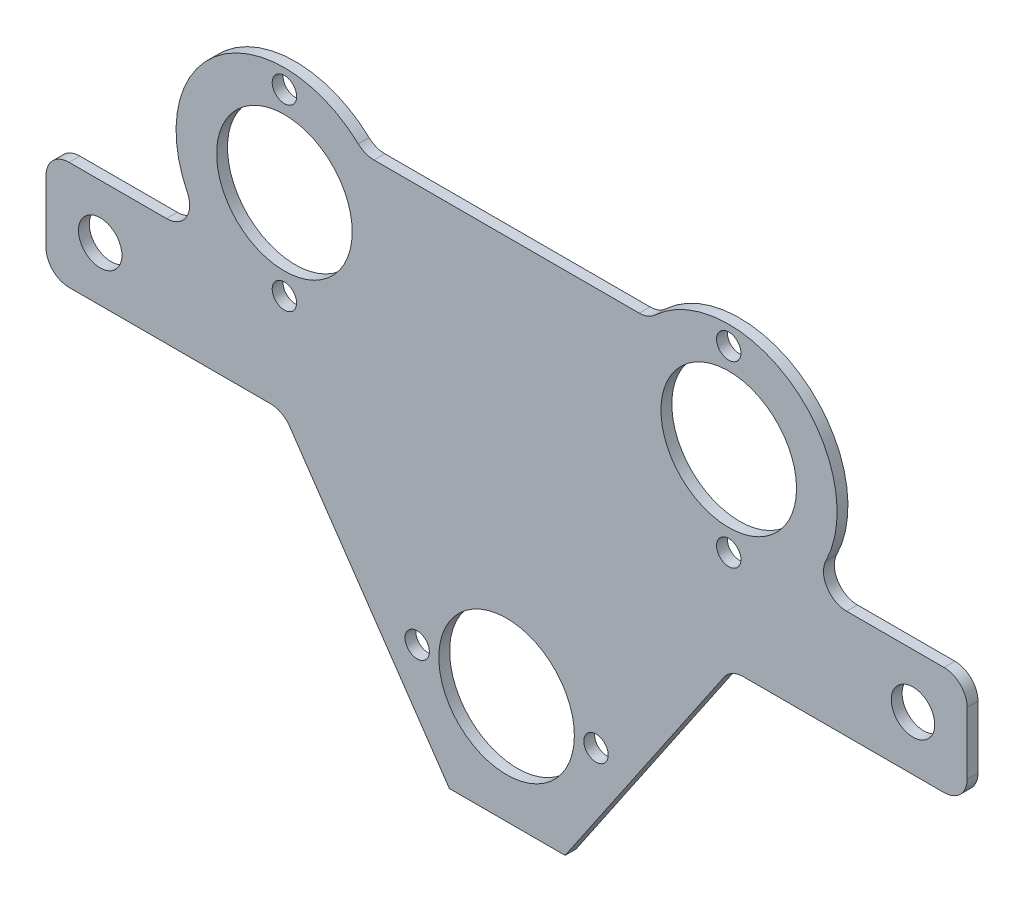
ISO-10303-21;
HEADER;
FILE_DESCRIPTION(('STEP AP214'),'2;1');
FILE_NAME('part.step','',(''),(''),'','','');
FILE_SCHEMA(('AUTOMOTIVE_DESIGN { 1 0 10303 214 1 1 1 1 }'));
ENDSEC;
DATA;
#1=APPLICATION_CONTEXT('core data for automotive mechanical design processes');
#2=APPLICATION_PROTOCOL_DEFINITION('international standard','automotive_design',2000,#1);
#3=PRODUCT_CONTEXT('',#1,'mechanical');
#4=PRODUCT('Part','Part','',(#3));
#5=PRODUCT_RELATED_PRODUCT_CATEGORY('part','',(#4));
#6=PRODUCT_DEFINITION_FORMATION('','',#4);
#7=PRODUCT_DEFINITION_CONTEXT('part definition',#1,'design');
#8=PRODUCT_DEFINITION('design','',#6,#7);
#9=PRODUCT_DEFINITION_SHAPE('','',#8);
#10=(LENGTH_UNIT() NAMED_UNIT(*) SI_UNIT(.MILLI.,.METRE.));
#11=(NAMED_UNIT(*) PLANE_ANGLE_UNIT() SI_UNIT($,.RADIAN.));
#12=(NAMED_UNIT(*) SI_UNIT($,.STERADIAN.) SOLID_ANGLE_UNIT());
#13=UNCERTAINTY_MEASURE_WITH_UNIT(LENGTH_MEASURE(1.E-05),#10,'distance_accuracy_value','');
#14=(GEOMETRIC_REPRESENTATION_CONTEXT(3) GLOBAL_UNCERTAINTY_ASSIGNED_CONTEXT((#13)) GLOBAL_UNIT_ASSIGNED_CONTEXT((#10,
#11,#12)) REPRESENTATION_CONTEXT('',''));
#15=CARTESIAN_POINT('',(0.,0.,0.));
#16=DIRECTION('',(0.,0.,1.));
#17=DIRECTION('',(1.,0.,0.));
#18=AXIS2_PLACEMENT_3D('',#15,#16,#17);
#19=CARTESIAN_POINT('',(0.,38.5,2.));
#20=DIRECTION('',(0.,1.,0.));
#21=DIRECTION('',(-1.,0.,0.));
#22=AXIS2_PLACEMENT_3D('',#19,#20,#21);
#23=PLANE('',#22);
#24=DIRECTION('',(1.,0.,0.));
#25=VECTOR('',#24,1.);
#26=CARTESIAN_POINT('',(0.,38.5,2.));
#27=LINE('',#26,#25);
#28=CARTESIAN_POINT('',(-24.4772883581417,38.5,2.));
#29=VERTEX_POINT('',#28);
#30=CARTESIAN_POINT('',(24.4772883581417,38.5,2.));
#31=VERTEX_POINT('',#30);
#32=EDGE_CURVE('E294',#29,#31,#27,.T.);
#33=ORIENTED_EDGE('',*,*,#32,.T.);
#34=DIRECTION('',(0.,0.,-1.));
#35=VECTOR('',#34,1.);
#36=CARTESIAN_POINT('',(24.4772883581417,38.5,2.));
#37=LINE('',#36,#35);
#38=CARTESIAN_POINT('',(24.4772883581417,38.5,0.));
#39=VERTEX_POINT('',#38);
#40=EDGE_CURVE('E356',#31,#39,#37,.T.);
#41=ORIENTED_EDGE('',*,*,#40,.T.);
#42=DIRECTION('',(1.,0.,0.));
#43=VECTOR('',#42,1.);
#44=CARTESIAN_POINT('',(0.,38.5,0.));
#45=LINE('',#44,#43);
#46=CARTESIAN_POINT('',(-24.4772883581417,38.5,0.));
#47=VERTEX_POINT('',#46);
#48=EDGE_CURVE('E246',#47,#39,#45,.T.);
#49=ORIENTED_EDGE('',*,*,#48,.F.);
#50=DIRECTION('',(0.,0.,-1.));
#51=VECTOR('',#50,1.);
#52=CARTESIAN_POINT('',(-24.4772883581417,38.5,2.));
#53=LINE('',#52,#51);
#54=EDGE_CURVE('E354',#47,#29,#53,.F.);
#55=ORIENTED_EDGE('',*,*,#54,.T.);
#56=EDGE_LOOP('',(#33,#41,#49,#55));
#57=FACE_BOUND('',#56,.T.);
#58=ADVANCED_FACE('F35',(#57),#23,.T.);
#59=CARTESIAN_POINT('',(-41.,25.,2.));
#60=DIRECTION('',(0.,0.,-1.));
#61=DIRECTION('',(-1.,0.,0.));
#62=AXIS2_PLACEMENT_3D('',#59,#60,#61);
#63=CYLINDRICAL_SURFACE('',#62,20.);
#64=CARTESIAN_POINT('',(-41.,25.,0.));
#65=DIRECTION('',(0.,0.,1.));
#66=DIRECTION('',(1.,0.,0.));
#67=AXIS2_PLACEMENT_3D('',#64,#65,#66);
#68=CIRCLE('',#67,20.);
#69=CARTESIAN_POINT('',(-27.3730213263024,39.639175257732,0.));
#70=VERTEX_POINT('',#69);
#71=CARTESIAN_POINT('',(-58.9274763870385,16.1340206185567,0.));
#72=VERTEX_POINT('',#71);
#73=EDGE_CURVE('E249',#70,#72,#68,.T.);
#74=ORIENTED_EDGE('',*,*,#73,.T.);
#75=DIRECTION('',(0.,0.,-1.));
#76=VECTOR('',#75,1.);
#77=CARTESIAN_POINT('',(-58.9274763870385,16.1340206185567,2.));
#78=LINE('',#77,#76);
#79=CARTESIAN_POINT('',(-58.9274763870385,16.1340206185567,2.));
#80=VERTEX_POINT('',#79);
#81=EDGE_CURVE('E348',#72,#80,#78,.F.);
#82=ORIENTED_EDGE('',*,*,#81,.T.);
#83=CARTESIAN_POINT('',(-41.,25.,2.));
#84=DIRECTION('',(0.,0.,1.));
#85=DIRECTION('',(1.,0.,0.));
#86=AXIS2_PLACEMENT_3D('',#83,#84,#85);
#87=CIRCLE('',#86,20.);
#88=CARTESIAN_POINT('',(-27.3730213263024,39.639175257732,2.));
#89=VERTEX_POINT('',#88);
#90=EDGE_CURVE('E392',#89,#80,#87,.T.);
#91=ORIENTED_EDGE('',*,*,#90,.F.);
#92=DIRECTION('',(0.,0.,-1.));
#93=VECTOR('',#92,1.);
#94=CARTESIAN_POINT('',(-27.3730213263024,39.639175257732,2.));
#95=LINE('',#94,#93);
#96=EDGE_CURVE('E345',#89,#70,#95,.T.);
#97=ORIENTED_EDGE('',*,*,#96,.T.);
#98=EDGE_LOOP('',(#74,#82,#91,#97));
#99=FACE_BOUND('',#98,.T.);
#100=ADVANCED_FACE('F395',(#99),#63,.T.);
#101=CARTESIAN_POINT('',(0.,10.,2.));
#102=DIRECTION('',(0.,1.,0.));
#103=DIRECTION('',(-1.,0.,0.));
#104=AXIS2_PLACEMENT_3D('',#101,#102,#103);
#105=PLANE('',#104);
#106=DIRECTION('',(1.,0.,0.));
#107=VECTOR('',#106,1.);
#108=CARTESIAN_POINT('',(0.,10.,0.));
#109=LINE('',#108,#107);
#110=CARTESIAN_POINT('',(-80.75,10.,0.));
#111=VERTEX_POINT('',#110);
#112=CARTESIAN_POINT('',(-62.7370651192842,10.,0.));
#113=VERTEX_POINT('',#112);
#114=EDGE_CURVE('E253',#111,#113,#109,.T.);
#115=ORIENTED_EDGE('',*,*,#114,.F.);
#116=DIRECTION('',(0.,0.,-1.));
#117=VECTOR('',#116,1.);
#118=CARTESIAN_POINT('',(-80.75,10.,2.));
#119=LINE('',#118,#117);
#120=CARTESIAN_POINT('',(-80.75,10.,2.));
#121=VERTEX_POINT('',#120);
#122=EDGE_CURVE('E324',#111,#121,#119,.F.);
#123=ORIENTED_EDGE('',*,*,#122,.T.);
#124=DIRECTION('',(1.,0.,0.));
#125=VECTOR('',#124,1.);
#126=CARTESIAN_POINT('',(0.,10.,2.));
#127=LINE('',#126,#125);
#128=CARTESIAN_POINT('',(-62.7370651192842,10.,2.));
#129=VERTEX_POINT('',#128);
#130=EDGE_CURVE('E397',#121,#129,#127,.T.);
#131=ORIENTED_EDGE('',*,*,#130,.T.);
#132=DIRECTION('',(0.,0.,-1.));
#133=VECTOR('',#132,1.);
#134=CARTESIAN_POINT('',(-62.7370651192842,10.,2.));
#135=LINE('',#134,#133);
#136=EDGE_CURVE('E321',#129,#113,#135,.T.);
#137=ORIENTED_EDGE('',*,*,#136,.T.);
#138=EDGE_LOOP('',(#115,#123,#131,#137));
#139=FACE_BOUND('',#138,.T.);
#140=ADVANCED_FACE('F437',(#139),#105,.T.);
#141=CARTESIAN_POINT('',(-85.,0.,2.));
#142=DIRECTION('',(1.,0.,0.));
#143=DIRECTION('',(0.,0.,-1.));
#144=AXIS2_PLACEMENT_3D('',#141,#142,#143);
#145=PLANE('',#144);
#146=DIRECTION('',(0.,-1.,0.));
#147=VECTOR('',#146,1.);
#148=CARTESIAN_POINT('',(-85.,0.,0.));
#149=LINE('',#148,#147);
#150=CARTESIAN_POINT('',(-85.,5.75,0.));
#151=VERTEX_POINT('',#150);
#152=CARTESIAN_POINT('',(-85.,-5.75,0.));
#153=VERTEX_POINT('',#152);
#154=EDGE_CURVE('E256',#151,#153,#149,.T.);
#155=ORIENTED_EDGE('',*,*,#154,.T.);
#156=DIRECTION('',(0.,0.,-1.));
#157=VECTOR('',#156,1.);
#158=CARTESIAN_POINT('',(-85.,-5.75,2.));
#159=LINE('',#158,#157);
#160=CARTESIAN_POINT('',(-85.,-5.75,2.));
#161=VERTEX_POINT('',#160);
#162=EDGE_CURVE('E311',#153,#161,#159,.F.);
#163=ORIENTED_EDGE('',*,*,#162,.T.);
#164=DIRECTION('',(0.,-1.,0.));
#165=VECTOR('',#164,1.);
#166=CARTESIAN_POINT('',(-85.,0.,2.));
#167=LINE('',#166,#165);
#168=CARTESIAN_POINT('',(-85.,5.75,2.));
#169=VERTEX_POINT('',#168);
#170=EDGE_CURVE('E215',#169,#161,#167,.T.);
#171=ORIENTED_EDGE('',*,*,#170,.F.);
#172=DIRECTION('',(0.,0.,-1.));
#173=VECTOR('',#172,1.);
#174=CARTESIAN_POINT('',(-85.,5.75,0.));
#175=LINE('',#174,#173);
#176=EDGE_CURVE('E308',#169,#151,#175,.T.);
#177=ORIENTED_EDGE('',*,*,#176,.T.);
#178=EDGE_LOOP('',(#155,#163,#171,#177));
#179=FACE_BOUND('',#178,.T.);
#180=ADVANCED_FACE('F467',(#179),#145,.F.);
#181=CARTESIAN_POINT('',(0.,-9.99999999999999,2.));
#182=DIRECTION('',(0.,1.,0.));
#183=DIRECTION('',(-1.,0.,0.));
#184=AXIS2_PLACEMENT_3D('',#181,#182,#183);
#185=PLANE('',#184);
#186=DIRECTION('',(1.,0.,0.));
#187=VECTOR('',#186,1.);
#188=CARTESIAN_POINT('',(0.,-9.99999999999999,2.));
#189=LINE('',#188,#187);
#190=CARTESIAN_POINT('',(-80.75,-10.,2.));
#191=VERTEX_POINT('',#190);
#192=CARTESIAN_POINT('',(-43.5501560500891,-9.99999999999999,2.));
#193=VERTEX_POINT('',#192);
#194=EDGE_CURVE('E213',#191,#193,#189,.T.);
#195=ORIENTED_EDGE('',*,*,#194,.F.);
#196=DIRECTION('',(0.,0.,-1.));
#197=VECTOR('',#196,1.);
#198=CARTESIAN_POINT('',(-80.75,-10.,2.));
#199=LINE('',#198,#197);
#200=CARTESIAN_POINT('',(-80.75,-10.,0.));
#201=VERTEX_POINT('',#200);
#202=EDGE_CURVE('E297',#191,#201,#199,.T.);
#203=ORIENTED_EDGE('',*,*,#202,.T.);
#204=DIRECTION('',(1.,0.,0.));
#205=VECTOR('',#204,1.);
#206=CARTESIAN_POINT('',(0.,-9.99999999999999,0.));
#207=LINE('',#206,#205);
#208=CARTESIAN_POINT('',(-43.5501560500891,-9.99999999999999,0.));
#209=VERTEX_POINT('',#208);
#210=EDGE_CURVE('E259',#201,#209,#207,.T.);
#211=ORIENTED_EDGE('',*,*,#210,.T.);
#212=DIRECTION('',(0.,0.,-1.));
#213=VECTOR('',#212,1.);
#214=CARTESIAN_POINT('',(-43.5501560500891,-9.99999999999999,2.));
#215=LINE('',#214,#213);
#216=EDGE_CURVE('E196',#209,#193,#215,.F.);
#217=ORIENTED_EDGE('',*,*,#216,.T.);
#218=EDGE_LOOP('',(#195,#203,#211,#217));
#219=FACE_BOUND('',#218,.T.);
#220=ADVANCED_FACE('F415',(#219),#185,.F.);
#221=CARTESIAN_POINT('',(-32.8166231841159,-22.4246925091459,2.));
#222=DIRECTION('',(-0.825644641500814,-0.564190505025556,0.));
#223=DIRECTION('',(0.564190505025556,-0.825644641500814,0.));
#224=AXIS2_PLACEMENT_3D('',#221,#222,#223);
#225=PLANE('',#224);
#226=DIRECTION('',(-0.564190505025556,0.825644641500814,0.));
#227=VECTOR('',#226,1.);
#228=CARTESIAN_POINT('',(-32.8166231841159,-22.4246925091459,2.));
#229=LINE('',#228,#227);
#230=CARTESIAN_POINT('',(-10.5568297320322,-55.,2.));
#231=VERTEX_POINT('',#230);
#232=CARTESIAN_POINT('',(-40.0411663237106,-11.8521903536414,2.));
#233=VERTEX_POINT('',#232);
#234=EDGE_CURVE('E190',#231,#233,#229,.T.);
#235=ORIENTED_EDGE('',*,*,#234,.T.);
#236=DIRECTION('',(0.,0.,-1.));
#237=VECTOR('',#236,1.);
#238=CARTESIAN_POINT('',(-40.0411663237106,-11.8521903536414,2.));
#239=LINE('',#238,#237);
#240=CARTESIAN_POINT('',(-40.0411663237106,-11.8521903536414,0.));
#241=VERTEX_POINT('',#240);
#242=EDGE_CURVE('E352',#233,#241,#239,.T.);
#243=ORIENTED_EDGE('',*,*,#242,.T.);
#244=DIRECTION('',(-0.564190505025556,0.825644641500814,0.));
#245=VECTOR('',#244,1.);
#246=CARTESIAN_POINT('',(-32.8166231841159,-22.4246925091459,0.));
#247=LINE('',#246,#245);
#248=CARTESIAN_POINT('',(-10.5568297320322,-55.,0.));
#249=VERTEX_POINT('',#248);
#250=EDGE_CURVE('E193',#249,#241,#247,.T.);
#251=ORIENTED_EDGE('',*,*,#250,.F.);
#252=DIRECTION('',(0.,0.,-1.));
#253=VECTOR('',#252,1.);
#254=CARTESIAN_POINT('',(-10.5568297320322,-55.,2.));
#255=LINE('',#254,#253);
#256=EDGE_CURVE('E185',#231,#249,#255,.T.);
#257=ORIENTED_EDGE('',*,*,#256,.F.);
#258=EDGE_LOOP('',(#235,#243,#251,#257));
#259=FACE_BOUND('',#258,.T.);
#260=ADVANCED_FACE('F187',(#259),#225,.T.);
#261=CARTESIAN_POINT('',(0.,-55.,2.));
#262=DIRECTION('',(0.,1.,0.));
#263=DIRECTION('',(0.,0.,1.));
#264=AXIS2_PLACEMENT_3D('',#261,#262,#263);
#265=PLANE('',#264);
#266=DIRECTION('',(1.,0.,0.));
#267=VECTOR('',#266,1.);
#268=CARTESIAN_POINT('',(0.,-55.,0.));
#269=LINE('',#268,#267);
#270=CARTESIAN_POINT('',(10.8054066591257,-55.,0.));
#271=VERTEX_POINT('',#270);
#272=EDGE_CURVE('E263',#249,#271,#269,.T.);
#273=ORIENTED_EDGE('',*,*,#272,.T.);
#274=DIRECTION('',(0.,0.,-1.));
#275=VECTOR('',#274,1.);
#276=CARTESIAN_POINT('',(10.8054066591257,-55.,2.));
#277=LINE('',#276,#275);
#278=CARTESIAN_POINT('',(10.8054066591257,-55.,2.));
#279=VERTEX_POINT('',#278);
#280=EDGE_CURVE('E197',#279,#271,#277,.T.);
#281=ORIENTED_EDGE('',*,*,#280,.F.);
#282=DIRECTION('',(1.,0.,0.));
#283=VECTOR('',#282,1.);
#284=CARTESIAN_POINT('',(0.,-55.,2.));
#285=LINE('',#284,#283);
#286=EDGE_CURVE('E200',#231,#279,#285,.T.);
#287=ORIENTED_EDGE('',*,*,#286,.F.);
#288=ORIENTED_EDGE('',*,*,#256,.T.);
#289=EDGE_LOOP('',(#273,#281,#287,#288));
#290=FACE_BOUND('',#289,.T.);
#291=ADVANCED_FACE('F201',(#290),#265,.F.);
#292=CARTESIAN_POINT('',(32.9610127368237,-22.4030611264261,2.));
#293=DIRECTION('',(-0.827048144621342,0.562131093676908,0.));
#294=DIRECTION('',(-0.562131093676908,-0.827048144621342,0.));
#295=AXIS2_PLACEMENT_3D('',#292,#293,#294);
#296=PLANE('',#295);
#297=DIRECTION('',(0.562131093676908,0.827048144621342,0.));
#298=VECTOR('',#297,1.);
#299=CARTESIAN_POINT('',(32.9610127368237,-22.4030611264261,0.));
#300=LINE('',#299,#298);
#301=CARTESIAN_POINT('',(40.1263180626206,-11.8609428518731,0.));
#302=VERTEX_POINT('',#301);
#303=EDGE_CURVE('E265',#271,#302,#300,.T.);
#304=ORIENTED_EDGE('',*,*,#303,.T.);
#305=DIRECTION('',(0.,0.,-1.));
#306=VECTOR('',#305,1.);
#307=CARTESIAN_POINT('',(40.1263180626206,-11.8609428518731,2.));
#308=LINE('',#307,#306);
#309=CARTESIAN_POINT('',(40.1263180626206,-11.8609428518731,2.));
#310=VERTEX_POINT('',#309);
#311=EDGE_CURVE('E350',#302,#310,#308,.F.);
#312=ORIENTED_EDGE('',*,*,#311,.T.);
#313=DIRECTION('',(0.562131093676908,0.827048144621342,0.));
#314=VECTOR('',#313,1.);
#315=CARTESIAN_POINT('',(32.9610127368237,-22.4030611264261,2.));
#316=LINE('',#315,#314);
#317=EDGE_CURVE('E205',#279,#310,#316,.T.);
#318=ORIENTED_EDGE('',*,*,#317,.F.);
#319=ORIENTED_EDGE('',*,*,#280,.T.);
#320=EDGE_LOOP('',(#304,#312,#318,#319));
#321=FACE_BOUND('',#320,.T.);
#322=ADVANCED_FACE('F480',(#321),#296,.F.);
#323=CARTESIAN_POINT('',(0.,-9.99999999999999,2.));
#324=DIRECTION('',(0.,1.,0.));
#325=DIRECTION('',(-1.,0.,0.));
#326=AXIS2_PLACEMENT_3D('',#323,#324,#325);
#327=PLANE('',#326);
#328=DIRECTION('',(1.,0.,0.));
#329=VECTOR('',#328,1.);
#330=CARTESIAN_POINT('',(0.,-9.99999999999999,0.));
#331=LINE('',#330,#329);
#332=CARTESIAN_POINT('',(43.6412726772613,-9.99999999999998,0.));
#333=VERTEX_POINT('',#332);
#334=CARTESIAN_POINT('',(80.75,-9.99999999999998,0.));
#335=VERTEX_POINT('',#334);
#336=EDGE_CURVE('E268',#333,#335,#331,.T.);
#337=ORIENTED_EDGE('',*,*,#336,.T.);
#338=DIRECTION('',(0.,0.,-1.));
#339=VECTOR('',#338,1.);
#340=CARTESIAN_POINT('',(80.75,-9.99999999999998,2.));
#341=LINE('',#340,#339);
#342=CARTESIAN_POINT('',(80.75,-9.99999999999998,2.));
#343=VERTEX_POINT('',#342);
#344=EDGE_CURVE('E334',#335,#343,#341,.F.);
#345=ORIENTED_EDGE('',*,*,#344,.T.);
#346=DIRECTION('',(1.,0.,0.));
#347=VECTOR('',#346,1.);
#348=CARTESIAN_POINT('',(0.,-9.99999999999999,2.));
#349=LINE('',#348,#347);
#350=CARTESIAN_POINT('',(43.6412726772613,-9.99999999999998,2.));
#351=VERTEX_POINT('',#350);
#352=EDGE_CURVE('E220',#351,#343,#349,.T.);
#353=ORIENTED_EDGE('',*,*,#352,.F.);
#354=DIRECTION('',(0.,0.,-1.));
#355=VECTOR('',#354,1.);
#356=CARTESIAN_POINT('',(43.6412726772613,-9.99999999999998,0.));
#357=LINE('',#356,#355);
#358=EDGE_CURVE('E331',#351,#333,#357,.T.);
#359=ORIENTED_EDGE('',*,*,#358,.T.);
#360=EDGE_LOOP('',(#337,#345,#353,#359));
#361=FACE_BOUND('',#360,.T.);
#362=ADVANCED_FACE('F483',(#361),#327,.F.);
#363=CARTESIAN_POINT('',(85.,0.,2.));
#364=DIRECTION('',(1.,0.,0.));
#365=DIRECTION('',(0.,0.,-1.));
#366=AXIS2_PLACEMENT_3D('',#363,#364,#365);
#367=PLANE('',#366);
#368=DIRECTION('',(0.,-1.,0.));
#369=VECTOR('',#368,1.);
#370=CARTESIAN_POINT('',(85.,0.,2.));
#371=LINE('',#370,#369);
#372=CARTESIAN_POINT('',(85.,5.75000000000002,2.));
#373=VERTEX_POINT('',#372);
#374=CARTESIAN_POINT('',(85.,-5.74999999999998,2.));
#375=VERTEX_POINT('',#374);
#376=EDGE_CURVE('E223',#373,#375,#371,.T.);
#377=ORIENTED_EDGE('',*,*,#376,.T.);
#378=DIRECTION('',(0.,0.,-1.));
#379=VECTOR('',#378,1.);
#380=CARTESIAN_POINT('',(85.,-5.74999999999998,0.));
#381=LINE('',#380,#379);
#382=CARTESIAN_POINT('',(85.,-5.74999999999998,0.));
#383=VERTEX_POINT('',#382);
#384=EDGE_CURVE('E328',#375,#383,#381,.T.);
#385=ORIENTED_EDGE('',*,*,#384,.T.);
#386=DIRECTION('',(0.,-1.,0.));
#387=VECTOR('',#386,1.);
#388=CARTESIAN_POINT('',(85.,0.,0.));
#389=LINE('',#388,#387);
#390=CARTESIAN_POINT('',(85.,5.75000000000002,0.));
#391=VERTEX_POINT('',#390);
#392=EDGE_CURVE('E271',#391,#383,#389,.T.);
#393=ORIENTED_EDGE('',*,*,#392,.F.);
#394=DIRECTION('',(0.,0.,-1.));
#395=VECTOR('',#394,1.);
#396=CARTESIAN_POINT('',(85.,5.75000000000002,2.));
#397=LINE('',#396,#395);
#398=EDGE_CURVE('E326',#391,#373,#397,.F.);
#399=ORIENTED_EDGE('',*,*,#398,.T.);
#400=EDGE_LOOP('',(#377,#385,#393,#399));
#401=FACE_BOUND('',#400,.T.);
#402=ADVANCED_FACE('F487',(#401),#367,.T.);
#403=CARTESIAN_POINT('',(0.,10.,2.));
#404=DIRECTION('',(0.,1.,0.));
#405=DIRECTION('',(-1.,0.,0.));
#406=AXIS2_PLACEMENT_3D('',#403,#404,#405);
#407=PLANE('',#406);
#408=DIRECTION('',(1.,0.,0.));
#409=VECTOR('',#408,1.);
#410=CARTESIAN_POINT('',(0.,10.,2.));
#411=LINE('',#410,#409);
#412=CARTESIAN_POINT('',(62.7370651192842,10.,2.));
#413=VERTEX_POINT('',#412);
#414=CARTESIAN_POINT('',(80.75,10.,2.));
#415=VERTEX_POINT('',#414);
#416=EDGE_CURVE('E226',#413,#415,#411,.T.);
#417=ORIENTED_EDGE('',*,*,#416,.T.);
#418=DIRECTION('',(0.,0.,-1.));
#419=VECTOR('',#418,1.);
#420=CARTESIAN_POINT('',(80.75,10.,2.));
#421=LINE('',#420,#419);
#422=CARTESIAN_POINT('',(80.75,10.,0.));
#423=VERTEX_POINT('',#422);
#424=EDGE_CURVE('E338',#415,#423,#421,.T.);
#425=ORIENTED_EDGE('',*,*,#424,.T.);
#426=DIRECTION('',(1.,0.,0.));
#427=VECTOR('',#426,1.);
#428=CARTESIAN_POINT('',(0.,10.,0.));
#429=LINE('',#428,#427);
#430=CARTESIAN_POINT('',(62.7370651192842,10.,0.));
#431=VERTEX_POINT('',#430);
#432=EDGE_CURVE('E274',#431,#423,#429,.T.);
#433=ORIENTED_EDGE('',*,*,#432,.F.);
#434=DIRECTION('',(0.,0.,-1.));
#435=VECTOR('',#434,1.);
#436=CARTESIAN_POINT('',(62.7370651192842,10.,2.));
#437=LINE('',#436,#435);
#438=EDGE_CURVE('E336',#431,#413,#437,.F.);
#439=ORIENTED_EDGE('',*,*,#438,.T.);
#440=EDGE_LOOP('',(#417,#425,#433,#439));
#441=FACE_BOUND('',#440,.T.);
#442=ADVANCED_FACE('F491',(#441),#407,.T.);
#443=CARTESIAN_POINT('',(41.,25.,2.));
#444=DIRECTION('',(0.,0.,-1.));
#445=DIRECTION('',(-1.,0.,0.));
#446=AXIS2_PLACEMENT_3D('',#443,#444,#445);
#447=CYLINDRICAL_SURFACE('',#446,12.51);
#448=CARTESIAN_POINT('',(41.,25.,2.));
#449=DIRECTION('',(0.,0.,1.));
#450=DIRECTION('',(1.,0.,0.));
#451=AXIS2_PLACEMENT_3D('',#448,#449,#450);
#452=CIRCLE('',#451,12.51);
#453=CARTESIAN_POINT('',(53.51,25.,2.));
#454=VERTEX_POINT('',#453);
#455=EDGE_CURVE('E240',#454,#454,#452,.F.);
#456=ORIENTED_EDGE('',*,*,#455,.F.);
#457=EDGE_LOOP('',(#456));
#458=FACE_BOUND('',#457,.T.);
#459=CARTESIAN_POINT('',(41.,25.,0.));
#460=DIRECTION('',(0.,0.,1.));
#461=DIRECTION('',(1.,0.,0.));
#462=AXIS2_PLACEMENT_3D('',#459,#460,#461);
#463=CIRCLE('',#462,12.51);
#464=CARTESIAN_POINT('',(53.51,25.,0.));
#465=VERTEX_POINT('',#464);
#466=EDGE_CURVE('E288',#465,#465,#463,.F.);
#467=ORIENTED_EDGE('',*,*,#466,.T.);
#468=EDGE_LOOP('',(#467));
#469=FACE_BOUND('',#468,.T.);
#470=ADVANCED_FACE('F495',(#458,#469),#447,.F.);
#471=CARTESIAN_POINT('',(-75.,0.,2.));
#472=DIRECTION('',(0.,0.,-1.));
#473=DIRECTION('',(-1.,0.,0.));
#474=AXIS2_PLACEMENT_3D('',#471,#472,#473);
#475=CYLINDRICAL_SURFACE('',#474,4.01);
#476=CARTESIAN_POINT('',(-75.,0.,2.));
#477=DIRECTION('',(0.,0.,1.));
#478=DIRECTION('',(1.,0.,0.));
#479=AXIS2_PLACEMENT_3D('',#476,#477,#478);
#480=CIRCLE('',#479,4.01);
#481=CARTESIAN_POINT('',(-70.99,0.,2.));
#482=VERTEX_POINT('',#481);
#483=EDGE_CURVE('E237',#482,#482,#480,.T.);
#484=ORIENTED_EDGE('',*,*,#483,.T.);
#485=EDGE_LOOP('',(#484));
#486=FACE_BOUND('',#485,.T.);
#487=CARTESIAN_POINT('',(-75.,0.,0.));
#488=DIRECTION('',(0.,0.,1.));
#489=DIRECTION('',(1.,0.,0.));
#490=AXIS2_PLACEMENT_3D('',#487,#488,#489);
#491=CIRCLE('',#490,4.01);
#492=CARTESIAN_POINT('',(-70.99,0.,0.));
#493=VERTEX_POINT('',#492);
#494=EDGE_CURVE('E285',#493,#493,#491,.T.);
#495=ORIENTED_EDGE('',*,*,#494,.F.);
#496=EDGE_LOOP('',(#495));
#497=FACE_BOUND('',#496,.T.);
#498=ADVANCED_FACE('F508',(#486,#497),#475,.F.);
#499=CARTESIAN_POINT('',(75.,0.,2.));
#500=DIRECTION('',(0.,0.,-1.));
#501=DIRECTION('',(-1.,0.,0.));
#502=AXIS2_PLACEMENT_3D('',#499,#500,#501);
#503=CYLINDRICAL_SURFACE('',#502,4.01);
#504=CARTESIAN_POINT('',(75.,0.,2.));
#505=DIRECTION('',(0.,0.,1.));
#506=DIRECTION('',(1.,0.,0.));
#507=AXIS2_PLACEMENT_3D('',#504,#505,#506);
#508=CIRCLE('',#507,4.01);
#509=CARTESIAN_POINT('',(79.01,0.,2.));
#510=VERTEX_POINT('',#509);
#511=EDGE_CURVE('E234',#510,#510,#508,.F.);
#512=ORIENTED_EDGE('',*,*,#511,.F.);
#513=EDGE_LOOP('',(#512));
#514=FACE_BOUND('',#513,.T.);
#515=CARTESIAN_POINT('',(75.,0.,0.));
#516=DIRECTION('',(0.,0.,1.));
#517=DIRECTION('',(1.,0.,0.));
#518=AXIS2_PLACEMENT_3D('',#515,#516,#517);
#519=CIRCLE('',#518,4.01);
#520=CARTESIAN_POINT('',(79.01,0.,0.));
#521=VERTEX_POINT('',#520);
#522=EDGE_CURVE('E282',#521,#521,#519,.F.);
#523=ORIENTED_EDGE('',*,*,#522,.T.);
#524=EDGE_LOOP('',(#523));
#525=FACE_BOUND('',#524,.T.);
#526=ADVANCED_FACE('F504',(#514,#525),#503,.F.);
#527=CARTESIAN_POINT('',(-41.,25.,2.));
#528=DIRECTION('',(0.,0.,-1.));
#529=DIRECTION('',(-1.,0.,0.));
#530=AXIS2_PLACEMENT_3D('',#527,#528,#529);
#531=CYLINDRICAL_SURFACE('',#530,12.51);
#532=CARTESIAN_POINT('',(-41.,25.,2.));
#533=DIRECTION('',(0.,0.,1.));
#534=DIRECTION('',(1.,0.,0.));
#535=AXIS2_PLACEMENT_3D('',#532,#533,#534);
#536=CIRCLE('',#535,12.51);
#537=CARTESIAN_POINT('',(-28.49,25.,2.));
#538=VERTEX_POINT('',#537);
#539=EDGE_CURVE('E231',#538,#538,#536,.T.);
#540=ORIENTED_EDGE('',*,*,#539,.T.);
#541=EDGE_LOOP('',(#540));
#542=FACE_BOUND('',#541,.T.);
#543=CARTESIAN_POINT('',(-41.,25.,0.));
#544=DIRECTION('',(0.,0.,1.));
#545=DIRECTION('',(1.,0.,0.));
#546=AXIS2_PLACEMENT_3D('',#543,#544,#545);
#547=CIRCLE('',#546,12.51);
#548=CARTESIAN_POINT('',(-28.49,25.,0.));
#549=VERTEX_POINT('',#548);
#550=EDGE_CURVE('E279',#549,#549,#547,.T.);
#551=ORIENTED_EDGE('',*,*,#550,.F.);
#552=EDGE_LOOP('',(#551));
#553=FACE_BOUND('',#552,.T.);
#554=ADVANCED_FACE('F501',(#542,#553),#531,.F.);
#555=CARTESIAN_POINT('',(41.,25.,2.));
#556=DIRECTION('',(0.,0.,-1.));
#557=DIRECTION('',(-1.,0.,0.));
#558=AXIS2_PLACEMENT_3D('',#555,#556,#557);
#559=CYLINDRICAL_SURFACE('',#558,20.);
#560=CARTESIAN_POINT('',(41.,25.,2.));
#561=DIRECTION('',(0.,0.,1.));
#562=DIRECTION('',(1.,0.,0.));
#563=AXIS2_PLACEMENT_3D('',#560,#561,#562);
#564=CIRCLE('',#563,20.);
#565=CARTESIAN_POINT('',(58.9274763870385,16.1340206185567,2.));
#566=VERTEX_POINT('',#565);
#567=CARTESIAN_POINT('',(27.3730213263024,39.639175257732,2.));
#568=VERTEX_POINT('',#567);
#569=EDGE_CURVE('E229',#566,#568,#564,.T.);
#570=ORIENTED_EDGE('',*,*,#569,.F.);
#571=DIRECTION('',(0.,0.,-1.));
#572=VECTOR('',#571,1.);
#573=CARTESIAN_POINT('',(58.9274763870385,16.1340206185567,2.));
#574=LINE('',#573,#572);
#575=CARTESIAN_POINT('',(58.9274763870385,16.1340206185567,0.));
#576=VERTEX_POINT('',#575);
#577=EDGE_CURVE('E342',#566,#576,#574,.T.);
#578=ORIENTED_EDGE('',*,*,#577,.T.);
#579=CARTESIAN_POINT('',(41.,25.,0.));
#580=DIRECTION('',(0.,0.,1.));
#581=DIRECTION('',(1.,0.,0.));
#582=AXIS2_PLACEMENT_3D('',#579,#580,#581);
#583=CIRCLE('',#582,20.);
#584=CARTESIAN_POINT('',(27.3730213263024,39.639175257732,0.));
#585=VERTEX_POINT('',#584);
#586=EDGE_CURVE('E277',#576,#585,#583,.T.);
#587=ORIENTED_EDGE('',*,*,#586,.T.);
#588=DIRECTION('',(0.,0.,-1.));
#589=VECTOR('',#588,1.);
#590=CARTESIAN_POINT('',(27.3730213263024,39.639175257732,2.));
#591=LINE('',#590,#589);
#592=EDGE_CURVE('E50',#585,#568,#591,.F.);
#593=ORIENTED_EDGE('',*,*,#592,.T.);
#594=EDGE_LOOP('',(#570,#578,#587,#593));
#595=FACE_BOUND('',#594,.T.);
#596=ADVANCED_FACE('F497',(#595),#559,.T.);
#597=CARTESIAN_POINT('',(0.,-35.,2.));
#598=DIRECTION('',(0.,0.,-1.));
#599=DIRECTION('',(-1.,0.,0.));
#600=AXIS2_PLACEMENT_3D('',#597,#598,#599);
#601=CYLINDRICAL_SURFACE('',#600,12.51);
#602=CARTESIAN_POINT('',(0.,-35.,2.));
#603=DIRECTION('',(0.,0.,1.));
#604=DIRECTION('',(1.,0.,0.));
#605=AXIS2_PLACEMENT_3D('',#602,#603,#604);
#606=CIRCLE('',#605,12.51);
#607=CARTESIAN_POINT('',(12.51,-35.,2.));
#608=VERTEX_POINT('',#607);
#609=EDGE_CURVE('E243',#608,#608,#606,.T.);
#610=ORIENTED_EDGE('',*,*,#609,.T.);
#611=EDGE_LOOP('',(#610));
#612=FACE_BOUND('',#611,.T.);
#613=CARTESIAN_POINT('',(0.,-35.,0.));
#614=DIRECTION('',(0.,0.,1.));
#615=DIRECTION('',(1.,0.,0.));
#616=AXIS2_PLACEMENT_3D('',#613,#614,#615);
#617=CIRCLE('',#616,12.51);
#618=CARTESIAN_POINT('',(12.51,-35.,0.));
#619=VERTEX_POINT('',#618);
#620=EDGE_CURVE('E291',#619,#619,#617,.T.);
#621=ORIENTED_EDGE('',*,*,#620,.F.);
#622=EDGE_LOOP('',(#621));
#623=FACE_BOUND('',#622,.T.);
#624=ADVANCED_FACE('F500',(#612,#623),#601,.F.);
#625=CARTESIAN_POINT('',(0.,0.,2.));
#626=DIRECTION('',(0.,0.,1.));
#627=DIRECTION('',(1.,0.,0.));
#628=AXIS2_PLACEMENT_3D('',#625,#626,#627);
#629=PLANE('',#628);
#630=CARTESIAN_POINT('',(41.,41.5,2.));
#631=DIRECTION('',(0.,0.,1.));
#632=DIRECTION('',(1.,0.,0.));
#633=AXIS2_PLACEMENT_3D('',#630,#631,#632);
#634=CIRCLE('',#633,2.25);
#635=CARTESIAN_POINT('',(43.25,41.5,2.));
#636=VERTEX_POINT('',#635);
#637=EDGE_CURVE('E583',#636,#636,#634,.T.);
#638=ORIENTED_EDGE('',*,*,#637,.F.);
#639=EDGE_LOOP('',(#638));
#640=FACE_BOUND('',#639,.T.);
#641=CARTESIAN_POINT('',(41.,8.50000000000001,2.));
#642=DIRECTION('',(0.,0.,1.));
#643=DIRECTION('',(1.,0.,0.));
#644=AXIS2_PLACEMENT_3D('',#641,#642,#643);
#645=CIRCLE('',#644,2.25);
#646=CARTESIAN_POINT('',(43.25,8.50000000000001,2.));
#647=VERTEX_POINT('',#646);
#648=EDGE_CURVE('E577',#647,#647,#645,.T.);
#649=ORIENTED_EDGE('',*,*,#648,.F.);
#650=EDGE_LOOP('',(#649));
#651=FACE_BOUND('',#650,.T.);
#652=CARTESIAN_POINT('',(16.5,-35.,2.));
#653=DIRECTION('',(0.,0.,1.));
#654=DIRECTION('',(1.,0.,0.));
#655=AXIS2_PLACEMENT_3D('',#652,#653,#654);
#656=CIRCLE('',#655,2.25);
#657=CARTESIAN_POINT('',(18.75,-35.,2.));
#658=VERTEX_POINT('',#657);
#659=EDGE_CURVE('E571',#658,#658,#656,.T.);
#660=ORIENTED_EDGE('',*,*,#659,.F.);
#661=EDGE_LOOP('',(#660));
#662=FACE_BOUND('',#661,.T.);
#663=CARTESIAN_POINT('',(-41.,8.5,2.));
#664=DIRECTION('',(0.,0.,1.));
#665=DIRECTION('',(1.,0.,0.));
#666=AXIS2_PLACEMENT_3D('',#663,#664,#665);
#667=CIRCLE('',#666,2.25);
#668=CARTESIAN_POINT('',(-38.75,8.5,2.));
#669=VERTEX_POINT('',#668);
#670=EDGE_CURVE('E565',#669,#669,#667,.T.);
#671=ORIENTED_EDGE('',*,*,#670,.F.);
#672=EDGE_LOOP('',(#671));
#673=FACE_BOUND('',#672,.T.);
#674=CARTESIAN_POINT('',(-16.5,-35.,2.));
#675=DIRECTION('',(0.,0.,1.));
#676=DIRECTION('',(1.,0.,0.));
#677=AXIS2_PLACEMENT_3D('',#674,#675,#676);
#678=CIRCLE('',#677,2.25);
#679=CARTESIAN_POINT('',(-14.25,-35.,2.));
#680=VERTEX_POINT('',#679);
#681=EDGE_CURVE('E553',#680,#680,#678,.T.);
#682=ORIENTED_EDGE('',*,*,#681,.F.);
#683=EDGE_LOOP('',(#682));
#684=FACE_BOUND('',#683,.T.);
#685=CARTESIAN_POINT('',(-41.,41.5,2.));
#686=DIRECTION('',(0.,0.,1.));
#687=DIRECTION('',(1.,0.,0.));
#688=AXIS2_PLACEMENT_3D('',#685,#686,#687);
#689=CIRCLE('',#688,2.25);
#690=CARTESIAN_POINT('',(-38.75,41.5,2.));
#691=VERTEX_POINT('',#690);
#692=EDGE_CURVE('E558',#691,#691,#689,.T.);
#693=ORIENTED_EDGE('',*,*,#692,.F.);
#694=EDGE_LOOP('',(#693));
#695=FACE_BOUND('',#694,.T.);
#696=ORIENTED_EDGE('',*,*,#170,.T.);
#697=CARTESIAN_POINT('',(-80.75,-5.75,2.));
#698=DIRECTION('',(0.,0.,1.));
#699=DIRECTION('',(1.,0.,0.));
#700=AXIS2_PLACEMENT_3D('',#697,#698,#699);
#701=CIRCLE('',#700,4.25);
#702=EDGE_CURVE('E319',#161,#191,#701,.T.);
#703=ORIENTED_EDGE('',*,*,#702,.T.);
#704=ORIENTED_EDGE('',*,*,#194,.T.);
#705=CARTESIAN_POINT('',(-43.5501560500891,-14.25,2.));
#706=DIRECTION('',(0.,0.,1.));
#707=DIRECTION('',(1.,0.,0.));
#708=AXIS2_PLACEMENT_3D('',#705,#706,#707);
#709=CIRCLE('',#708,4.25);
#710=EDGE_CURVE('E212',#193,#233,#709,.F.);
#711=ORIENTED_EDGE('',*,*,#710,.T.);
#712=ORIENTED_EDGE('',*,*,#234,.F.);
#713=ORIENTED_EDGE('',*,*,#286,.T.);
#714=ORIENTED_EDGE('',*,*,#317,.T.);
#715=CARTESIAN_POINT('',(43.6412726772613,-14.25,2.));
#716=DIRECTION('',(0.,0.,1.));
#717=DIRECTION('',(1.,0.,0.));
#718=AXIS2_PLACEMENT_3D('',#715,#716,#717);
#719=CIRCLE('',#718,4.25);
#720=EDGE_CURVE('E368',#310,#351,#719,.F.);
#721=ORIENTED_EDGE('',*,*,#720,.T.);
#722=ORIENTED_EDGE('',*,*,#352,.T.);
#723=CARTESIAN_POINT('',(80.75,-5.74999999999998,2.));
#724=DIRECTION('',(0.,0.,1.));
#725=DIRECTION('',(1.,0.,0.));
#726=AXIS2_PLACEMENT_3D('',#723,#724,#725);
#727=CIRCLE('',#726,4.25);
#728=EDGE_CURVE('E315',#343,#375,#727,.T.);
#729=ORIENTED_EDGE('',*,*,#728,.T.);
#730=ORIENTED_EDGE('',*,*,#376,.F.);
#731=CARTESIAN_POINT('',(80.75,5.75000000000002,2.));
#732=DIRECTION('',(0.,0.,1.));
#733=DIRECTION('',(1.,0.,0.));
#734=AXIS2_PLACEMENT_3D('',#731,#732,#733);
#735=CIRCLE('',#734,4.25);
#736=EDGE_CURVE('E313',#373,#415,#735,.T.);
#737=ORIENTED_EDGE('',*,*,#736,.T.);
#738=ORIENTED_EDGE('',*,*,#416,.F.);
#739=CARTESIAN_POINT('',(62.7370651192842,14.25,2.));
#740=DIRECTION('',(0.,0.,1.));
#741=DIRECTION('',(1.,0.,0.));
#742=AXIS2_PLACEMENT_3D('',#739,#740,#741);
#743=CIRCLE('',#742,4.25);
#744=EDGE_CURVE('E57',#413,#566,#743,.F.);
#745=ORIENTED_EDGE('',*,*,#744,.T.);
#746=ORIENTED_EDGE('',*,*,#569,.T.);
#747=CARTESIAN_POINT('',(24.4772883581417,42.75,2.));
#748=DIRECTION('',(0.,0.,1.));
#749=DIRECTION('',(1.,0.,0.));
#750=AXIS2_PLACEMENT_3D('',#747,#748,#749);
#751=CIRCLE('',#750,4.25);
#752=EDGE_CURVE('E375',#568,#31,#751,.F.);
#753=ORIENTED_EDGE('',*,*,#752,.T.);
#754=ORIENTED_EDGE('',*,*,#32,.F.);
#755=CARTESIAN_POINT('',(-24.4772883581417,42.75,2.));
#756=DIRECTION('',(0.,0.,1.));
#757=DIRECTION('',(1.,0.,0.));
#758=AXIS2_PLACEMENT_3D('',#755,#756,#757);
#759=CIRCLE('',#758,4.25);
#760=EDGE_CURVE('E11',#29,#89,#759,.F.);
#761=ORIENTED_EDGE('',*,*,#760,.T.);
#762=ORIENTED_EDGE('',*,*,#90,.T.);
#763=CARTESIAN_POINT('',(-62.7370651192842,14.25,2.));
#764=DIRECTION('',(0.,0.,1.));
#765=DIRECTION('',(1.,0.,0.));
#766=AXIS2_PLACEMENT_3D('',#763,#764,#765);
#767=CIRCLE('',#766,4.25);
#768=EDGE_CURVE('E364',#80,#129,#767,.F.);
#769=ORIENTED_EDGE('',*,*,#768,.T.);
#770=ORIENTED_EDGE('',*,*,#130,.F.);
#771=CARTESIAN_POINT('',(-80.75,5.75,2.));
#772=DIRECTION('',(0.,0.,1.));
#773=DIRECTION('',(1.,0.,0.));
#774=AXIS2_PLACEMENT_3D('',#771,#772,#773);
#775=CIRCLE('',#774,4.25);
#776=EDGE_CURVE('E317',#121,#169,#775,.T.);
#777=ORIENTED_EDGE('',*,*,#776,.T.);
#778=EDGE_LOOP('',(#696,#703,#704,#711,#712,#713,#714,#721,#722,#729,#730,#737,#738,#745,#746,
#753,#754,#761,#762,#769,#770,#777));
#779=FACE_BOUND('',#778,.T.);
#780=ORIENTED_EDGE('',*,*,#539,.F.);
#781=EDGE_LOOP('',(#780));
#782=FACE_BOUND('',#781,.T.);
#783=ORIENTED_EDGE('',*,*,#511,.T.);
#784=EDGE_LOOP('',(#783));
#785=FACE_BOUND('',#784,.T.);
#786=ORIENTED_EDGE('',*,*,#483,.F.);
#787=EDGE_LOOP('',(#786));
#788=FACE_BOUND('',#787,.T.);
#789=ORIENTED_EDGE('',*,*,#455,.T.);
#790=EDGE_LOOP('',(#789));
#791=FACE_BOUND('',#790,.T.);
#792=ORIENTED_EDGE('',*,*,#609,.F.);
#793=EDGE_LOOP('',(#792));
#794=FACE_BOUND('',#793,.T.);
#795=ADVANCED_FACE('F208',(#640,#651,#662,#673,#684,#695,#779,#782,#785,#788,#791,#794),#629,.T.);
#796=CARTESIAN_POINT('',(0.,0.,0.));
#797=DIRECTION('',(0.,0.,1.));
#798=DIRECTION('',(1.,0.,0.));
#799=AXIS2_PLACEMENT_3D('',#796,#797,#798);
#800=PLANE('',#799);
#801=CARTESIAN_POINT('',(41.,41.5,0.));
#802=DIRECTION('',(0.,0.,1.));
#803=DIRECTION('',(1.,0.,0.));
#804=AXIS2_PLACEMENT_3D('',#801,#802,#803);
#805=CIRCLE('',#804,2.25);
#806=CARTESIAN_POINT('',(43.25,41.5,0.));
#807=VERTEX_POINT('',#806);
#808=EDGE_CURVE('E580',#807,#807,#805,.F.);
#809=ORIENTED_EDGE('',*,*,#808,.F.);
#810=EDGE_LOOP('',(#809));
#811=FACE_BOUND('',#810,.T.);
#812=CARTESIAN_POINT('',(41.,8.50000000000001,0.));
#813=DIRECTION('',(0.,0.,1.));
#814=DIRECTION('',(1.,0.,0.));
#815=AXIS2_PLACEMENT_3D('',#812,#813,#814);
#816=CIRCLE('',#815,2.25);
#817=CARTESIAN_POINT('',(43.25,8.50000000000001,0.));
#818=VERTEX_POINT('',#817);
#819=EDGE_CURVE('E574',#818,#818,#816,.F.);
#820=ORIENTED_EDGE('',*,*,#819,.F.);
#821=EDGE_LOOP('',(#820));
#822=FACE_BOUND('',#821,.T.);
#823=CARTESIAN_POINT('',(16.5,-35.,0.));
#824=DIRECTION('',(0.,0.,1.));
#825=DIRECTION('',(1.,0.,0.));
#826=AXIS2_PLACEMENT_3D('',#823,#824,#825);
#827=CIRCLE('',#826,2.25);
#828=CARTESIAN_POINT('',(18.75,-35.,0.));
#829=VERTEX_POINT('',#828);
#830=EDGE_CURVE('E568',#829,#829,#827,.F.);
#831=ORIENTED_EDGE('',*,*,#830,.F.);
#832=EDGE_LOOP('',(#831));
#833=FACE_BOUND('',#832,.T.);
#834=CARTESIAN_POINT('',(-41.,8.5,0.));
#835=DIRECTION('',(0.,0.,1.));
#836=DIRECTION('',(1.,0.,0.));
#837=AXIS2_PLACEMENT_3D('',#834,#835,#836);
#838=CIRCLE('',#837,2.25);
#839=CARTESIAN_POINT('',(-38.75,8.5,0.));
#840=VERTEX_POINT('',#839);
#841=EDGE_CURVE('E562',#840,#840,#838,.F.);
#842=ORIENTED_EDGE('',*,*,#841,.F.);
#843=EDGE_LOOP('',(#842));
#844=FACE_BOUND('',#843,.T.);
#845=CARTESIAN_POINT('',(-16.5,-35.,0.));
#846=DIRECTION('',(0.,0.,1.));
#847=DIRECTION('',(1.,0.,0.));
#848=AXIS2_PLACEMENT_3D('',#845,#846,#847);
#849=CIRCLE('',#848,2.25);
#850=CARTESIAN_POINT('',(-14.25,-35.,0.));
#851=VERTEX_POINT('',#850);
#852=EDGE_CURVE('E556',#851,#851,#849,.F.);
#853=ORIENTED_EDGE('',*,*,#852,.F.);
#854=EDGE_LOOP('',(#853));
#855=FACE_BOUND('',#854,.T.);
#856=CARTESIAN_POINT('',(-41.,41.5,0.));
#857=DIRECTION('',(0.,0.,1.));
#858=DIRECTION('',(1.,0.,0.));
#859=AXIS2_PLACEMENT_3D('',#856,#857,#858);
#860=CIRCLE('',#859,2.25);
#861=CARTESIAN_POINT('',(-38.75,41.5,0.));
#862=VERTEX_POINT('',#861);
#863=EDGE_CURVE('E250',#862,#862,#860,.F.);
#864=ORIENTED_EDGE('',*,*,#863,.F.);
#865=EDGE_LOOP('',(#864));
#866=FACE_BOUND('',#865,.T.);
#867=ORIENTED_EDGE('',*,*,#210,.F.);
#868=CARTESIAN_POINT('',(-80.75,-5.75,0.));
#869=DIRECTION('',(0.,0.,1.));
#870=DIRECTION('',(1.,0.,0.));
#871=AXIS2_PLACEMENT_3D('',#868,#869,#870);
#872=CIRCLE('',#871,4.25);
#873=EDGE_CURVE('E306',#201,#153,#872,.F.);
#874=ORIENTED_EDGE('',*,*,#873,.T.);
#875=ORIENTED_EDGE('',*,*,#154,.F.);
#876=CARTESIAN_POINT('',(-80.75,5.75,0.));
#877=DIRECTION('',(0.,0.,1.));
#878=DIRECTION('',(1.,0.,0.));
#879=AXIS2_PLACEMENT_3D('',#876,#877,#878);
#880=CIRCLE('',#879,4.25);
#881=EDGE_CURVE('E304',#151,#111,#880,.F.);
#882=ORIENTED_EDGE('',*,*,#881,.T.);
#883=ORIENTED_EDGE('',*,*,#114,.T.);
#884=CARTESIAN_POINT('',(-62.7370651192842,14.25,0.));
#885=DIRECTION('',(0.,0.,1.));
#886=DIRECTION('',(1.,0.,0.));
#887=AXIS2_PLACEMENT_3D('',#884,#885,#886);
#888=CIRCLE('',#887,4.25);
#889=EDGE_CURVE('E362',#113,#72,#888,.T.);
#890=ORIENTED_EDGE('',*,*,#889,.T.);
#891=ORIENTED_EDGE('',*,*,#73,.F.);
#892=CARTESIAN_POINT('',(-24.4772883581417,42.75,0.));
#893=DIRECTION('',(0.,0.,1.));
#894=DIRECTION('',(1.,0.,0.));
#895=AXIS2_PLACEMENT_3D('',#892,#893,#894);
#896=CIRCLE('',#895,4.25);
#897=EDGE_CURVE('E43',#70,#47,#896,.T.);
#898=ORIENTED_EDGE('',*,*,#897,.T.);
#899=ORIENTED_EDGE('',*,*,#48,.T.);
#900=CARTESIAN_POINT('',(24.4772883581417,42.75,0.));
#901=DIRECTION('',(0.,0.,1.));
#902=DIRECTION('',(1.,0.,0.));
#903=AXIS2_PLACEMENT_3D('',#900,#901,#902);
#904=CIRCLE('',#903,4.25);
#905=EDGE_CURVE('E373',#39,#585,#904,.T.);
#906=ORIENTED_EDGE('',*,*,#905,.T.);
#907=ORIENTED_EDGE('',*,*,#586,.F.);
#908=CARTESIAN_POINT('',(62.7370651192842,14.25,0.));
#909=DIRECTION('',(0.,0.,1.));
#910=DIRECTION('',(1.,0.,0.));
#911=AXIS2_PLACEMENT_3D('',#908,#909,#910);
#912=CIRCLE('',#911,4.25);
#913=EDGE_CURVE('E359',#576,#431,#912,.T.);
#914=ORIENTED_EDGE('',*,*,#913,.T.);
#915=ORIENTED_EDGE('',*,*,#432,.T.);
#916=CARTESIAN_POINT('',(80.75,5.75000000000002,0.));
#917=DIRECTION('',(0.,0.,1.));
#918=DIRECTION('',(1.,0.,0.));
#919=AXIS2_PLACEMENT_3D('',#916,#917,#918);
#920=CIRCLE('',#919,4.25);
#921=EDGE_CURVE('E300',#423,#391,#920,.F.);
#922=ORIENTED_EDGE('',*,*,#921,.T.);
#923=ORIENTED_EDGE('',*,*,#392,.T.);
#924=CARTESIAN_POINT('',(80.75,-5.74999999999998,0.));
#925=DIRECTION('',(0.,0.,1.));
#926=DIRECTION('',(1.,0.,0.));
#927=AXIS2_PLACEMENT_3D('',#924,#925,#926);
#928=CIRCLE('',#927,4.25);
#929=EDGE_CURVE('E302',#383,#335,#928,.F.);
#930=ORIENTED_EDGE('',*,*,#929,.T.);
#931=ORIENTED_EDGE('',*,*,#336,.F.);
#932=CARTESIAN_POINT('',(43.6412726772613,-14.25,0.));
#933=DIRECTION('',(0.,0.,1.));
#934=DIRECTION('',(1.,0.,0.));
#935=AXIS2_PLACEMENT_3D('',#932,#933,#934);
#936=CIRCLE('',#935,4.25);
#937=EDGE_CURVE('E366',#333,#302,#936,.T.);
#938=ORIENTED_EDGE('',*,*,#937,.T.);
#939=ORIENTED_EDGE('',*,*,#303,.F.);
#940=ORIENTED_EDGE('',*,*,#272,.F.);
#941=ORIENTED_EDGE('',*,*,#250,.T.);
#942=CARTESIAN_POINT('',(-43.5501560500891,-14.25,0.));
#943=DIRECTION('',(0.,0.,1.));
#944=DIRECTION('',(1.,0.,0.));
#945=AXIS2_PLACEMENT_3D('',#942,#943,#944);
#946=CIRCLE('',#945,4.25);
#947=EDGE_CURVE('E370',#241,#209,#946,.T.);
#948=ORIENTED_EDGE('',*,*,#947,.T.);
#949=EDGE_LOOP('',(#867,#874,#875,#882,#883,#890,#891,#898,#899,#906,#907,#914,#915,#922,#923,
#930,#931,#938,#939,#940,#941,#948));
#950=FACE_BOUND('',#949,.T.);
#951=ORIENTED_EDGE('',*,*,#550,.T.);
#952=EDGE_LOOP('',(#951));
#953=FACE_BOUND('',#952,.T.);
#954=ORIENTED_EDGE('',*,*,#522,.F.);
#955=EDGE_LOOP('',(#954));
#956=FACE_BOUND('',#955,.T.);
#957=ORIENTED_EDGE('',*,*,#494,.T.);
#958=EDGE_LOOP('',(#957));
#959=FACE_BOUND('',#958,.T.);
#960=ORIENTED_EDGE('',*,*,#466,.F.);
#961=EDGE_LOOP('',(#960));
#962=FACE_BOUND('',#961,.T.);
#963=ORIENTED_EDGE('',*,*,#620,.T.);
#964=EDGE_LOOP('',(#963));
#965=FACE_BOUND('',#964,.T.);
#966=ADVANCED_FACE('F380',(#811,#822,#833,#844,#855,#866,#950,#953,#956,#959,#962,#965),#800,.F.);
#967=CARTESIAN_POINT('',(-80.75,-5.75,2.));
#968=DIRECTION('',(0.,0.,-1.));
#969=DIRECTION('',(-1.,0.,0.));
#970=AXIS2_PLACEMENT_3D('',#967,#968,#969);
#971=CYLINDRICAL_SURFACE('',#970,4.25);
#972=ORIENTED_EDGE('',*,*,#702,.F.);
#973=ORIENTED_EDGE('',*,*,#162,.F.);
#974=ORIENTED_EDGE('',*,*,#873,.F.);
#975=ORIENTED_EDGE('',*,*,#202,.F.);
#976=EDGE_LOOP('',(#972,#973,#974,#975));
#977=FACE_BOUND('',#976,.T.);
#978=ADVANCED_FACE('F413',(#977),#971,.T.);
#979=CARTESIAN_POINT('',(-80.75,5.75,2.));
#980=DIRECTION('',(0.,0.,1.));
#981=DIRECTION('',(1.,0.,0.));
#982=AXIS2_PLACEMENT_3D('',#979,#980,#981);
#983=CYLINDRICAL_SURFACE('',#982,4.25);
#984=ORIENTED_EDGE('',*,*,#776,.F.);
#985=ORIENTED_EDGE('',*,*,#122,.F.);
#986=ORIENTED_EDGE('',*,*,#881,.F.);
#987=ORIENTED_EDGE('',*,*,#176,.F.);
#988=EDGE_LOOP('',(#984,#985,#986,#987));
#989=FACE_BOUND('',#988,.T.);
#990=ADVANCED_FACE('F443',(#989),#983,.T.);
#991=CARTESIAN_POINT('',(80.75,-5.74999999999998,2.));
#992=DIRECTION('',(0.,0.,1.));
#993=DIRECTION('',(1.,0.,0.));
#994=AXIS2_PLACEMENT_3D('',#991,#992,#993);
#995=CYLINDRICAL_SURFACE('',#994,4.25);
#996=ORIENTED_EDGE('',*,*,#728,.F.);
#997=ORIENTED_EDGE('',*,*,#344,.F.);
#998=ORIENTED_EDGE('',*,*,#929,.F.);
#999=ORIENTED_EDGE('',*,*,#384,.F.);
#1000=EDGE_LOOP('',(#996,#997,#998,#999));
#1001=FACE_BOUND('',#1000,.T.);
#1002=ADVANCED_FACE('F446',(#1001),#995,.T.);
#1003=CARTESIAN_POINT('',(80.75,5.75000000000002,2.));
#1004=DIRECTION('',(0.,0.,-1.));
#1005=DIRECTION('',(-1.,0.,0.));
#1006=AXIS2_PLACEMENT_3D('',#1003,#1004,#1005);
#1007=CYLINDRICAL_SURFACE('',#1006,4.25);
#1008=ORIENTED_EDGE('',*,*,#736,.F.);
#1009=ORIENTED_EDGE('',*,*,#398,.F.);
#1010=ORIENTED_EDGE('',*,*,#921,.F.);
#1011=ORIENTED_EDGE('',*,*,#424,.F.);
#1012=EDGE_LOOP('',(#1008,#1009,#1010,#1011));
#1013=FACE_BOUND('',#1012,.T.);
#1014=ADVANCED_FACE('F450',(#1013),#1007,.T.);
#1015=CARTESIAN_POINT('',(62.7370651192842,14.25,2.));
#1016=DIRECTION('',(0.,0.,-1.));
#1017=DIRECTION('',(-1.,0.,0.));
#1018=AXIS2_PLACEMENT_3D('',#1015,#1016,#1017);
#1019=CYLINDRICAL_SURFACE('',#1018,4.25);
#1020=ORIENTED_EDGE('',*,*,#744,.F.);
#1021=ORIENTED_EDGE('',*,*,#438,.F.);
#1022=ORIENTED_EDGE('',*,*,#913,.F.);
#1023=ORIENTED_EDGE('',*,*,#577,.F.);
#1024=EDGE_LOOP('',(#1020,#1021,#1022,#1023));
#1025=FACE_BOUND('',#1024,.T.);
#1026=ADVANCED_FACE('F454',(#1025),#1019,.F.);
#1027=CARTESIAN_POINT('',(-62.7370651192842,14.25,2.));
#1028=DIRECTION('',(0.,0.,-1.));
#1029=DIRECTION('',(-1.,0.,0.));
#1030=AXIS2_PLACEMENT_3D('',#1027,#1028,#1029);
#1031=CYLINDRICAL_SURFACE('',#1030,4.25);
#1032=ORIENTED_EDGE('',*,*,#768,.F.);
#1033=ORIENTED_EDGE('',*,*,#81,.F.);
#1034=ORIENTED_EDGE('',*,*,#889,.F.);
#1035=ORIENTED_EDGE('',*,*,#136,.F.);
#1036=EDGE_LOOP('',(#1032,#1033,#1034,#1035));
#1037=FACE_BOUND('',#1036,.T.);
#1038=ADVANCED_FACE('F429',(#1037),#1031,.F.);
#1039=CARTESIAN_POINT('',(43.6412726772613,-14.25,2.));
#1040=DIRECTION('',(0.,0.,1.));
#1041=DIRECTION('',(1.,0.,0.));
#1042=AXIS2_PLACEMENT_3D('',#1039,#1040,#1041);
#1043=CYLINDRICAL_SURFACE('',#1042,4.25);
#1044=ORIENTED_EDGE('',*,*,#720,.F.);
#1045=ORIENTED_EDGE('',*,*,#311,.F.);
#1046=ORIENTED_EDGE('',*,*,#937,.F.);
#1047=ORIENTED_EDGE('',*,*,#358,.F.);
#1048=EDGE_LOOP('',(#1044,#1045,#1046,#1047));
#1049=FACE_BOUND('',#1048,.T.);
#1050=ADVANCED_FACE('F422',(#1049),#1043,.F.);
#1051=CARTESIAN_POINT('',(-43.5501560500891,-14.25,2.));
#1052=DIRECTION('',(0.,0.,-1.));
#1053=DIRECTION('',(-1.,0.,0.));
#1054=AXIS2_PLACEMENT_3D('',#1051,#1052,#1053);
#1055=CYLINDRICAL_SURFACE('',#1054,4.25);
#1056=ORIENTED_EDGE('',*,*,#710,.F.);
#1057=ORIENTED_EDGE('',*,*,#216,.F.);
#1058=ORIENTED_EDGE('',*,*,#947,.F.);
#1059=ORIENTED_EDGE('',*,*,#242,.F.);
#1060=EDGE_LOOP('',(#1056,#1057,#1058,#1059));
#1061=FACE_BOUND('',#1060,.T.);
#1062=ADVANCED_FACE('F419',(#1061),#1055,.F.);
#1063=CARTESIAN_POINT('',(24.4772883581417,42.75,2.));
#1064=DIRECTION('',(0.,0.,-1.));
#1065=DIRECTION('',(-1.,0.,0.));
#1066=AXIS2_PLACEMENT_3D('',#1063,#1064,#1065);
#1067=CYLINDRICAL_SURFACE('',#1066,4.25);
#1068=ORIENTED_EDGE('',*,*,#752,.F.);
#1069=ORIENTED_EDGE('',*,*,#592,.F.);
#1070=ORIENTED_EDGE('',*,*,#905,.F.);
#1071=ORIENTED_EDGE('',*,*,#40,.F.);
#1072=EDGE_LOOP('',(#1068,#1069,#1070,#1071));
#1073=FACE_BOUND('',#1072,.T.);
#1074=ADVANCED_FACE('F421',(#1073),#1067,.F.);
#1075=CARTESIAN_POINT('',(-24.4772883581417,42.75,2.));
#1076=DIRECTION('',(0.,0.,-1.));
#1077=DIRECTION('',(-1.,0.,0.));
#1078=AXIS2_PLACEMENT_3D('',#1075,#1076,#1077);
#1079=CYLINDRICAL_SURFACE('',#1078,4.25);
#1080=ORIENTED_EDGE('',*,*,#760,.F.);
#1081=ORIENTED_EDGE('',*,*,#54,.F.);
#1082=ORIENTED_EDGE('',*,*,#897,.F.);
#1083=ORIENTED_EDGE('',*,*,#96,.F.);
#1084=EDGE_LOOP('',(#1080,#1081,#1082,#1083));
#1085=FACE_BOUND('',#1084,.T.);
#1086=ADVANCED_FACE('F37',(#1085),#1079,.F.);
#1087=CARTESIAN_POINT('',(-41.,41.5,-0.00100000000000013));
#1088=DIRECTION('',(0.,0.,1.));
#1089=DIRECTION('',(1.,0.,0.));
#1090=AXIS2_PLACEMENT_3D('',#1087,#1088,#1089);
#1091=CYLINDRICAL_SURFACE('',#1090,2.25);
#1092=ORIENTED_EDGE('',*,*,#692,.T.);
#1093=EDGE_LOOP('',(#1092));
#1094=FACE_BOUND('',#1093,.T.);
#1095=ORIENTED_EDGE('',*,*,#863,.T.);
#1096=EDGE_LOOP('',(#1095));
#1097=FACE_BOUND('',#1096,.T.);
#1098=ADVANCED_FACE('F525',(#1094,#1097),#1091,.F.);
#1099=CARTESIAN_POINT('',(-16.5,-35.,-0.00100000000000013));
#1100=DIRECTION('',(0.,0.,1.));
#1101=DIRECTION('',(1.,0.,0.));
#1102=AXIS2_PLACEMENT_3D('',#1099,#1100,#1101);
#1103=CYLINDRICAL_SURFACE('',#1102,2.25);
#1104=ORIENTED_EDGE('',*,*,#681,.T.);
#1105=EDGE_LOOP('',(#1104));
#1106=FACE_BOUND('',#1105,.T.);
#1107=ORIENTED_EDGE('',*,*,#852,.T.);
#1108=EDGE_LOOP('',(#1107));
#1109=FACE_BOUND('',#1108,.T.);
#1110=ADVANCED_FACE('F528',(#1106,#1109),#1103,.F.);
#1111=CARTESIAN_POINT('',(-41.,8.5,-0.00100000000000013));
#1112=DIRECTION('',(0.,0.,1.));
#1113=DIRECTION('',(1.,0.,0.));
#1114=AXIS2_PLACEMENT_3D('',#1111,#1112,#1113);
#1115=CYLINDRICAL_SURFACE('',#1114,2.25);
#1116=ORIENTED_EDGE('',*,*,#670,.T.);
#1117=EDGE_LOOP('',(#1116));
#1118=FACE_BOUND('',#1117,.T.);
#1119=ORIENTED_EDGE('',*,*,#841,.T.);
#1120=EDGE_LOOP('',(#1119));
#1121=FACE_BOUND('',#1120,.T.);
#1122=ADVANCED_FACE('F541',(#1118,#1121),#1115,.F.);
#1123=CARTESIAN_POINT('',(16.5,-35.,-0.00100000000000013));
#1124=DIRECTION('',(0.,0.,1.));
#1125=DIRECTION('',(1.,0.,0.));
#1126=AXIS2_PLACEMENT_3D('',#1123,#1124,#1125);
#1127=CYLINDRICAL_SURFACE('',#1126,2.25);
#1128=ORIENTED_EDGE('',*,*,#659,.T.);
#1129=EDGE_LOOP('',(#1128));
#1130=FACE_BOUND('',#1129,.T.);
#1131=ORIENTED_EDGE('',*,*,#830,.T.);
#1132=EDGE_LOOP('',(#1131));
#1133=FACE_BOUND('',#1132,.T.);
#1134=ADVANCED_FACE('F537',(#1130,#1133),#1127,.F.);
#1135=CARTESIAN_POINT('',(41.,8.50000000000001,-0.00100000000000013));
#1136=DIRECTION('',(0.,0.,1.));
#1137=DIRECTION('',(1.,0.,0.));
#1138=AXIS2_PLACEMENT_3D('',#1135,#1136,#1137);
#1139=CYLINDRICAL_SURFACE('',#1138,2.25);
#1140=ORIENTED_EDGE('',*,*,#648,.T.);
#1141=EDGE_LOOP('',(#1140));
#1142=FACE_BOUND('',#1141,.T.);
#1143=ORIENTED_EDGE('',*,*,#819,.T.);
#1144=EDGE_LOOP('',(#1143));
#1145=FACE_BOUND('',#1144,.T.);
#1146=ADVANCED_FACE('F533',(#1142,#1145),#1139,.F.);
#1147=CARTESIAN_POINT('',(41.,41.5,-0.00100000000000013));
#1148=DIRECTION('',(0.,0.,1.));
#1149=DIRECTION('',(1.,0.,0.));
#1150=AXIS2_PLACEMENT_3D('',#1147,#1148,#1149);
#1151=CYLINDRICAL_SURFACE('',#1150,2.25);
#1152=ORIENTED_EDGE('',*,*,#637,.T.);
#1153=EDGE_LOOP('',(#1152));
#1154=FACE_BOUND('',#1153,.T.);
#1155=ORIENTED_EDGE('',*,*,#808,.T.);
#1156=EDGE_LOOP('',(#1155));
#1157=FACE_BOUND('',#1156,.T.);
#1158=ADVANCED_FACE('F530',(#1154,#1157),#1151,.F.);
#1159=CLOSED_SHELL('',(#58,#100,#140,#180,#220,#260,#291,#322,#362,#402,#442,#470,#498,#526,
#554,#596,#624,#795,#966,#978,#990,#1002,#1014,#1026,#1038,#1050,#1062,#1074,#1086,#1098,#1110,
#1122,#1134,#1146,#1158));
#1160=MANIFOLD_SOLID_BREP('B2',#1159);
#1161=ADVANCED_BREP_SHAPE_REPRESENTATION('',(#18,#1160),#14);
#1162=SHAPE_DEFINITION_REPRESENTATION(#9,#1161);
ENDSEC;
END-ISO-10303-21;
